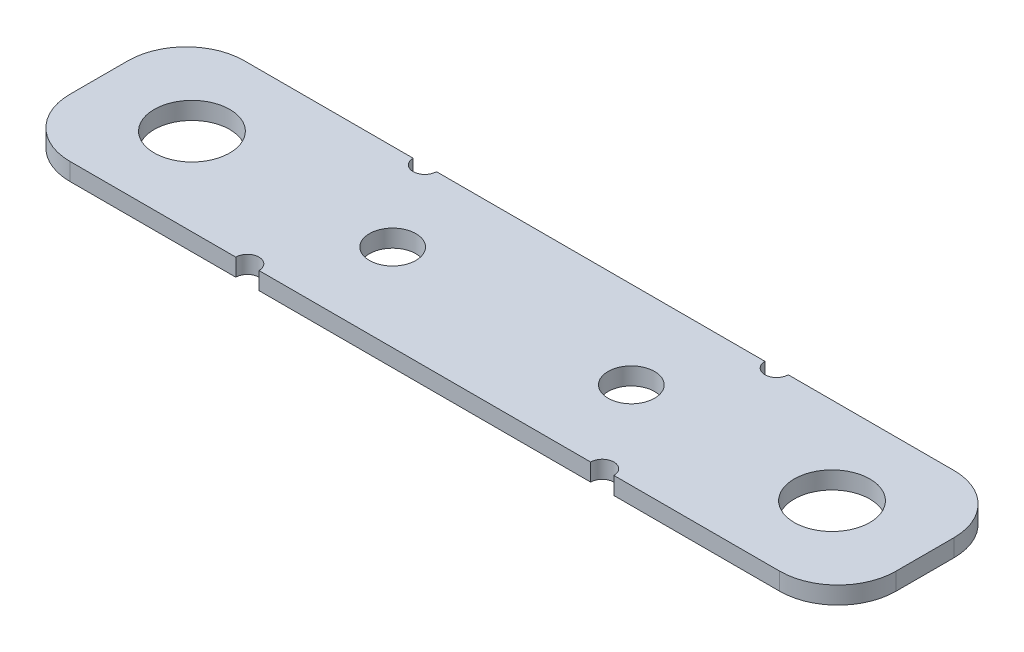
ISO-10303-21;
HEADER;
FILE_DESCRIPTION(('STEP AP214'),'2;1');
FILE_NAME('part.step','',(''),(''),'','','');
FILE_SCHEMA(('AUTOMOTIVE_DESIGN { 1 0 10303 214 1 1 1 1 }'));
ENDSEC;
DATA;
#1=APPLICATION_CONTEXT('core data for automotive mechanical design processes');
#2=APPLICATION_PROTOCOL_DEFINITION('international standard','automotive_design',2000,#1);
#3=PRODUCT_CONTEXT('',#1,'mechanical');
#4=PRODUCT('Part','Part','',(#3));
#5=PRODUCT_RELATED_PRODUCT_CATEGORY('part','',(#4));
#6=PRODUCT_DEFINITION_FORMATION('','',#4);
#7=PRODUCT_DEFINITION_CONTEXT('part definition',#1,'design');
#8=PRODUCT_DEFINITION('design','',#6,#7);
#9=PRODUCT_DEFINITION_SHAPE('','',#8);
#10=(LENGTH_UNIT() NAMED_UNIT(*) SI_UNIT(.MILLI.,.METRE.));
#11=(NAMED_UNIT(*) PLANE_ANGLE_UNIT() SI_UNIT($,.RADIAN.));
#12=(NAMED_UNIT(*) SI_UNIT($,.STERADIAN.) SOLID_ANGLE_UNIT());
#13=UNCERTAINTY_MEASURE_WITH_UNIT(LENGTH_MEASURE(1.E-05),#10,'distance_accuracy_value','');
#14=(GEOMETRIC_REPRESENTATION_CONTEXT(3) GLOBAL_UNCERTAINTY_ASSIGNED_CONTEXT((#13)) GLOBAL_UNIT_ASSIGNED_CONTEXT((#10,
#11,#12)) REPRESENTATION_CONTEXT('',''));
#15=CARTESIAN_POINT('',(0.,0.,0.));
#16=DIRECTION('',(0.,0.,1.));
#17=DIRECTION('',(1.,0.,0.));
#18=AXIS2_PLACEMENT_3D('',#15,#16,#17);
#19=CARTESIAN_POINT('',(-1.5,1.5,15.));
#20=DIRECTION('',(0.,0.,1.));
#21=DIRECTION('',(1.,0.,0.));
#22=AXIS2_PLACEMENT_3D('',#19,#20,#21);
#23=PLANE('',#22);
#24=DIRECTION('',(0.,1.,0.));
#25=VECTOR('',#24,1.);
#26=CARTESIAN_POINT('',(31.2671458676443,-1.5,15.));
#27=LINE('',#26,#25);
#28=CARTESIAN_POINT('',(31.2671458676443,-1.5,15.));
#29=VERTEX_POINT('',#28);
#30=CARTESIAN_POINT('',(31.2671458676443,0.,15.));
#31=VERTEX_POINT('',#30);
#32=EDGE_CURVE('E251',#29,#31,#27,.T.);
#33=ORIENTED_EDGE('',*,*,#32,.F.);
#34=DIRECTION('',(1.,0.,0.));
#35=VECTOR('',#34,1.);
#36=CARTESIAN_POINT('',(0.,-1.5,15.));
#37=LINE('',#36,#35);
#38=CARTESIAN_POINT('',(45.5342917352885,-1.5,15.));
#39=VERTEX_POINT('',#38);
#40=EDGE_CURVE('E240',#29,#39,#37,.T.);
#41=ORIENTED_EDGE('',*,*,#40,.T.);
#42=DIRECTION('',(0.,-1.,0.));
#43=VECTOR('',#42,1.);
#44=CARTESIAN_POINT('',(45.5342917352885,1.5,15.));
#45=LINE('',#44,#43);
#46=CARTESIAN_POINT('',(45.5342917352885,0.,15.));
#47=VERTEX_POINT('',#46);
#48=EDGE_CURVE('E249',#39,#47,#45,.F.);
#49=ORIENTED_EDGE('',*,*,#48,.T.);
#50=DIRECTION('',(1.,0.,0.));
#51=VECTOR('',#50,1.);
#52=CARTESIAN_POINT('',(0.,0.,15.));
#53=LINE('',#52,#51);
#54=EDGE_CURVE('E183',#31,#47,#53,.T.);
#55=ORIENTED_EDGE('',*,*,#54,.F.);
#56=EDGE_LOOP('',(#33,#41,#49,#55));
#57=FACE_BOUND('',#56,.T.);
#58=ADVANCED_FACE('F44',(#57),#23,.T.);
#59=DIRECTION('',(0.,1.,0.));
#60=VECTOR('',#59,1.);
#61=CARTESIAN_POINT('',(29.2671458676443,-1.5,15.));
#62=LINE('',#61,#60);
#63=CARTESIAN_POINT('',(29.2671458676443,0.,15.));
#64=VERTEX_POINT('',#63);
#65=CARTESIAN_POINT('',(29.2671458676443,-1.5,15.));
#66=VERTEX_POINT('',#65);
#67=EDGE_CURVE('E59',#64,#66,#62,.F.);
#68=ORIENTED_EDGE('',*,*,#67,.F.);
#69=CARTESIAN_POINT('',(0.732854132355741,0.,15.));
#70=VERTEX_POINT('',#69);
#71=EDGE_CURVE('E187',#70,#64,#53,.T.);
#72=ORIENTED_EDGE('',*,*,#71,.F.);
#73=DIRECTION('',(0.,1.,0.));
#74=VECTOR('',#73,1.);
#75=CARTESIAN_POINT('',(0.732854132355741,-1.5,15.));
#76=LINE('',#75,#74);
#77=CARTESIAN_POINT('',(0.732854132355741,-1.5,15.));
#78=VERTEX_POINT('',#77);
#79=EDGE_CURVE('E284',#78,#70,#76,.T.);
#80=ORIENTED_EDGE('',*,*,#79,.F.);
#81=EDGE_CURVE('E241',#78,#66,#37,.T.);
#82=ORIENTED_EDGE('',*,*,#81,.T.);
#83=EDGE_LOOP('',(#68,#72,#80,#82));
#84=FACE_BOUND('',#83,.T.);
#85=ADVANCED_FACE('F308',(#84),#23,.T.);
#86=CARTESIAN_POINT('',(31.5,1.5,0.));
#87=DIRECTION('',(0.,0.,-1.));
#88=DIRECTION('',(-1.,0.,0.));
#89=AXIS2_PLACEMENT_3D('',#86,#87,#88);
#90=PLANE('',#89);
#91=DIRECTION('',(0.,1.,0.));
#92=VECTOR('',#91,1.);
#93=CARTESIAN_POINT('',(29.2671458676443,-1.5,0.));
#94=LINE('',#93,#92);
#95=CARTESIAN_POINT('',(29.2671458676443,-1.5,0.));
#96=VERTEX_POINT('',#95);
#97=CARTESIAN_POINT('',(29.2671458676443,0.,0.));
#98=VERTEX_POINT('',#97);
#99=EDGE_CURVE('E321',#96,#98,#94,.T.);
#100=ORIENTED_EDGE('',*,*,#99,.F.);
#101=DIRECTION('',(1.,0.,0.));
#102=VECTOR('',#101,1.);
#103=CARTESIAN_POINT('',(0.,-1.5,0.));
#104=LINE('',#103,#102);
#105=CARTESIAN_POINT('',(1.,-1.5,0.));
#106=VERTEX_POINT('',#105);
#107=EDGE_CURVE('E184',#106,#96,#104,.T.);
#108=ORIENTED_EDGE('',*,*,#107,.F.);
#109=DIRECTION('',(0.,1.,0.));
#110=VECTOR('',#109,1.);
#111=CARTESIAN_POINT('',(1.,-1.5,0.));
#112=LINE('',#111,#110);
#113=CARTESIAN_POINT('',(1.,0.,0.));
#114=VERTEX_POINT('',#113);
#115=EDGE_CURVE('E161',#114,#106,#112,.F.);
#116=ORIENTED_EDGE('',*,*,#115,.F.);
#117=DIRECTION('',(1.,0.,0.));
#118=VECTOR('',#117,1.);
#119=CARTESIAN_POINT('',(0.,0.,0.));
#120=LINE('',#119,#118);
#121=EDGE_CURVE('E193',#114,#98,#120,.T.);
#122=ORIENTED_EDGE('',*,*,#121,.T.);
#123=EDGE_LOOP('',(#100,#108,#116,#122));
#124=FACE_BOUND('',#123,.T.);
#125=ADVANCED_FACE('F313',(#124),#90,.T.);
#126=DIRECTION('',(0.,1.,0.));
#127=VECTOR('',#126,1.);
#128=CARTESIAN_POINT('',(-1.,-1.5,0.));
#129=LINE('',#128,#127);
#130=CARTESIAN_POINT('',(-1.,-1.5,0.));
#131=VERTEX_POINT('',#130);
#132=CARTESIAN_POINT('',(-1.,0.,0.));
#133=VERTEX_POINT('',#132);
#134=EDGE_CURVE('E158',#131,#133,#129,.T.);
#135=ORIENTED_EDGE('',*,*,#134,.F.);
#136=CARTESIAN_POINT('',(-15.5342917352885,-1.5,0.));
#137=VERTEX_POINT('',#136);
#138=EDGE_CURVE('E171',#137,#131,#104,.T.);
#139=ORIENTED_EDGE('',*,*,#138,.F.);
#140=DIRECTION('',(0.,1.,0.));
#141=VECTOR('',#140,1.);
#142=CARTESIAN_POINT('',(-15.5342917352885,1.5,0.));
#143=LINE('',#142,#141);
#144=CARTESIAN_POINT('',(-15.5342917352885,0.,0.));
#145=VERTEX_POINT('',#144);
#146=EDGE_CURVE('E221',#137,#145,#143,.T.);
#147=ORIENTED_EDGE('',*,*,#146,.T.);
#148=EDGE_CURVE('E173',#145,#133,#120,.T.);
#149=ORIENTED_EDGE('',*,*,#148,.T.);
#150=EDGE_LOOP('',(#135,#139,#147,#149));
#151=FACE_BOUND('',#150,.T.);
#152=ADVANCED_FACE('F169',(#151),#90,.T.);
#153=DIRECTION('',(0.,1.,0.));
#154=VECTOR('',#153,1.);
#155=CARTESIAN_POINT('',(-1.26714586764426,-1.5,15.));
#156=LINE('',#155,#154);
#157=CARTESIAN_POINT('',(-1.26714586764426,0.,15.));
#158=VERTEX_POINT('',#157);
#159=CARTESIAN_POINT('',(-1.26714586764426,-1.5,15.));
#160=VERTEX_POINT('',#159);
#161=EDGE_CURVE('E67',#158,#160,#156,.F.);
#162=ORIENTED_EDGE('',*,*,#161,.F.);
#163=CARTESIAN_POINT('',(-15.5342917352885,0.,15.));
#164=VERTEX_POINT('',#163);
#165=EDGE_CURVE('E189',#164,#158,#53,.T.);
#166=ORIENTED_EDGE('',*,*,#165,.F.);
#167=DIRECTION('',(0.,1.,0.));
#168=VECTOR('',#167,1.);
#169=CARTESIAN_POINT('',(-15.5342917352885,-1.5,15.));
#170=LINE('',#169,#168);
#171=CARTESIAN_POINT('',(-15.5342917352885,-1.5,15.));
#172=VERTEX_POINT('',#171);
#173=EDGE_CURVE('E197',#164,#172,#170,.F.);
#174=ORIENTED_EDGE('',*,*,#173,.T.);
#175=EDGE_CURVE('E166',#172,#160,#37,.T.);
#176=ORIENTED_EDGE('',*,*,#175,.T.);
#177=EDGE_LOOP('',(#162,#166,#174,#176));
#178=FACE_BOUND('',#177,.T.);
#179=ADVANCED_FACE('F309',(#178),#23,.T.);
#180=DIRECTION('',(0.,1.,0.));
#181=VECTOR('',#180,1.);
#182=CARTESIAN_POINT('',(31.2671458676443,-1.5,0.));
#183=LINE('',#182,#181);
#184=CARTESIAN_POINT('',(31.2671458676443,0.,0.));
#185=VERTEX_POINT('',#184);
#186=CARTESIAN_POINT('',(31.2671458676443,-1.5,0.));
#187=VERTEX_POINT('',#186);
#188=EDGE_CURVE('E174',#185,#187,#183,.F.);
#189=ORIENTED_EDGE('',*,*,#188,.F.);
#190=CARTESIAN_POINT('',(45.5342917352885,0.,0.));
#191=VERTEX_POINT('',#190);
#192=EDGE_CURVE('E194',#185,#191,#120,.T.);
#193=ORIENTED_EDGE('',*,*,#192,.T.);
#194=DIRECTION('',(0.,-1.,0.));
#195=VECTOR('',#194,1.);
#196=CARTESIAN_POINT('',(45.5342917352885,1.5,0.));
#197=LINE('',#196,#195);
#198=CARTESIAN_POINT('',(45.5342917352885,-1.5,0.));
#199=VERTEX_POINT('',#198);
#200=EDGE_CURVE('E238',#191,#199,#197,.T.);
#201=ORIENTED_EDGE('',*,*,#200,.T.);
#202=EDGE_CURVE('E186',#187,#199,#104,.T.);
#203=ORIENTED_EDGE('',*,*,#202,.F.);
#204=EDGE_LOOP('',(#189,#193,#201,#203));
#205=FACE_BOUND('',#204,.T.);
#206=ADVANCED_FACE('F289',(#205),#90,.T.);
#207=CARTESIAN_POINT('',(0.,0.,15.));
#208=DIRECTION('',(0.,1.,0.));
#209=DIRECTION('',(0.,0.,1.));
#210=AXIS2_PLACEMENT_3D('',#207,#208,#209);
#211=PLANE('',#210);
#212=CARTESIAN_POINT('',(4.73285413235574,0.,7.50000000000001));
#213=DIRECTION('',(0.,1.,0.));
#214=DIRECTION('',(0.,0.,1.));
#215=AXIS2_PLACEMENT_3D('',#212,#213,#214);
#216=CIRCLE('',#215,2.);
#217=CARTESIAN_POINT('',(4.73285413235574,0.,9.50000000000001));
#218=VERTEX_POINT('',#217);
#219=EDGE_CURVE('E363',#218,#218,#216,.T.);
#220=ORIENTED_EDGE('',*,*,#219,.F.);
#221=EDGE_LOOP('',(#220));
#222=FACE_BOUND('',#221,.T.);
#223=CARTESIAN_POINT('',(30.2671458676443,0.,15.));
#224=DIRECTION('',(0.,1.,0.));
#225=DIRECTION('',(0.,0.,1.));
#226=AXIS2_PLACEMENT_3D('',#223,#224,#225);
#227=CIRCLE('',#226,1.);
#228=EDGE_CURVE('E353',#31,#64,#227,.T.);
#229=ORIENTED_EDGE('',*,*,#228,.F.);
#230=ORIENTED_EDGE('',*,*,#54,.T.);
#231=CARTESIAN_POINT('',(45.5342917352885,0.,10.));
#232=DIRECTION('',(0.,1.,0.));
#233=DIRECTION('',(0.,0.,1.));
#234=AXIS2_PLACEMENT_3D('',#231,#232,#233);
#235=CIRCLE('',#234,5.);
#236=CARTESIAN_POINT('',(50.5342917352885,0.,10.));
#237=VERTEX_POINT('',#236);
#238=EDGE_CURVE('E261',#47,#237,#235,.T.);
#239=ORIENTED_EDGE('',*,*,#238,.T.);
#240=DIRECTION('',(0.,0.,-1.));
#241=VECTOR('',#240,1.);
#242=CARTESIAN_POINT('',(50.5342917352885,0.,15.));
#243=LINE('',#242,#241);
#244=CARTESIAN_POINT('',(50.5342917352885,0.,5.));
#245=VERTEX_POINT('',#244);
#246=EDGE_CURVE('E268',#237,#245,#243,.T.);
#247=ORIENTED_EDGE('',*,*,#246,.T.);
#248=CARTESIAN_POINT('',(45.5342917352885,0.,5.));
#249=DIRECTION('',(0.,1.,0.));
#250=DIRECTION('',(0.,0.,1.));
#251=AXIS2_PLACEMENT_3D('',#248,#249,#250);
#252=CIRCLE('',#251,5.);
#253=EDGE_CURVE('E264',#245,#191,#252,.T.);
#254=ORIENTED_EDGE('',*,*,#253,.T.);
#255=ORIENTED_EDGE('',*,*,#192,.F.);
#256=CARTESIAN_POINT('',(30.2671458676443,0.,0.));
#257=DIRECTION('',(0.,1.,0.));
#258=DIRECTION('',(0.,0.,1.));
#259=AXIS2_PLACEMENT_3D('',#256,#257,#258);
#260=CIRCLE('',#259,1.);
#261=EDGE_CURVE('E340',#98,#185,#260,.T.);
#262=ORIENTED_EDGE('',*,*,#261,.F.);
#263=ORIENTED_EDGE('',*,*,#121,.F.);
#264=CARTESIAN_POINT('',(0.,0.,0.));
#265=DIRECTION('',(0.,1.,0.));
#266=DIRECTION('',(0.,0.,1.));
#267=AXIS2_PLACEMENT_3D('',#264,#265,#266);
#268=CIRCLE('',#267,1.);
#269=EDGE_CURVE('E339',#133,#114,#268,.T.);
#270=ORIENTED_EDGE('',*,*,#269,.F.);
#271=ORIENTED_EDGE('',*,*,#148,.F.);
#272=CARTESIAN_POINT('',(-15.5342917352885,0.,5.));
#273=DIRECTION('',(0.,1.,0.));
#274=DIRECTION('',(-1.,0.,0.));
#275=AXIS2_PLACEMENT_3D('',#272,#273,#274);
#276=CIRCLE('',#275,5.);
#277=CARTESIAN_POINT('',(-20.5342917352885,0.,5.));
#278=VERTEX_POINT('',#277);
#279=EDGE_CURVE('E226',#145,#278,#276,.T.);
#280=ORIENTED_EDGE('',*,*,#279,.T.);
#281=DIRECTION('',(0.,0.,-1.));
#282=VECTOR('',#281,1.);
#283=CARTESIAN_POINT('',(-20.5342917352885,0.,15.));
#284=LINE('',#283,#282);
#285=CARTESIAN_POINT('',(-20.5342917352885,0.,10.));
#286=VERTEX_POINT('',#285);
#287=EDGE_CURVE('E236',#286,#278,#284,.T.);
#288=ORIENTED_EDGE('',*,*,#287,.F.);
#289=CARTESIAN_POINT('',(-15.5342917352885,0.,10.));
#290=DIRECTION('',(0.,1.,0.));
#291=DIRECTION('',(-1.,0.,0.));
#292=AXIS2_PLACEMENT_3D('',#289,#290,#291);
#293=CIRCLE('',#292,5.);
#294=EDGE_CURVE('E223',#286,#164,#293,.T.);
#295=ORIENTED_EDGE('',*,*,#294,.T.);
#296=ORIENTED_EDGE('',*,*,#165,.T.);
#297=CARTESIAN_POINT('',(-0.267145867644259,0.,15.));
#298=DIRECTION('',(0.,1.,0.));
#299=DIRECTION('',(0.,0.,1.));
#300=AXIS2_PLACEMENT_3D('',#297,#298,#299);
#301=CIRCLE('',#300,1.);
#302=EDGE_CURVE('E325',#70,#158,#301,.T.);
#303=ORIENTED_EDGE('',*,*,#302,.F.);
#304=ORIENTED_EDGE('',*,*,#71,.T.);
#305=EDGE_LOOP('',(#229,#230,#239,#247,#254,#255,#262,#263,#270,#271,#280,#288,#295,#296,#303,#304));
#306=FACE_BOUND('',#305,.T.);
#307=CARTESIAN_POINT('',(25.2671458676443,0.,7.5));
#308=DIRECTION('',(0.,1.,0.));
#309=DIRECTION('',(0.,0.,1.));
#310=AXIS2_PLACEMENT_3D('',#307,#308,#309);
#311=CIRCLE('',#310,2.);
#312=CARTESIAN_POINT('',(25.2671458676443,0.,9.50000000000001));
#313=VERTEX_POINT('',#312);
#314=EDGE_CURVE('E358',#313,#313,#311,.T.);
#315=ORIENTED_EDGE('',*,*,#314,.F.);
#316=EDGE_LOOP('',(#315));
#317=FACE_BOUND('',#316,.T.);
#318=CARTESIAN_POINT('',(-12.5342917352885,0.,7.5));
#319=DIRECTION('',(0.,1.,0.));
#320=DIRECTION('',(-1.,0.,0.));
#321=AXIS2_PLACEMENT_3D('',#318,#319,#320);
#322=CIRCLE('',#321,3.25);
#323=CARTESIAN_POINT('',(-15.7842917352885,0.,7.5));
#324=VERTEX_POINT('',#323);
#325=EDGE_CURVE('E228',#324,#324,#322,.T.);
#326=ORIENTED_EDGE('',*,*,#325,.F.);
#327=EDGE_LOOP('',(#326));
#328=FACE_BOUND('',#327,.T.);
#329=CARTESIAN_POINT('',(42.5342917352885,0.,7.5));
#330=DIRECTION('',(0.,1.,0.));
#331=DIRECTION('',(0.,0.,1.));
#332=AXIS2_PLACEMENT_3D('',#329,#330,#331);
#333=CIRCLE('',#332,3.25);
#334=CARTESIAN_POINT('',(42.5342917352885,0.,10.75));
#335=VERTEX_POINT('',#334);
#336=EDGE_CURVE('E274',#335,#335,#333,.T.);
#337=ORIENTED_EDGE('',*,*,#336,.F.);
#338=EDGE_LOOP('',(#337));
#339=FACE_BOUND('',#338,.T.);
#340=ADVANCED_FACE('F46',(#222,#306,#317,#328,#339),#211,.T.);
#341=CARTESIAN_POINT('',(0.,-1.5,15.));
#342=DIRECTION('',(0.,1.,0.));
#343=DIRECTION('',(0.,0.,1.));
#344=AXIS2_PLACEMENT_3D('',#341,#342,#343);
#345=PLANE('',#344);
#346=CARTESIAN_POINT('',(4.73285413235574,-1.5,7.50000000000001));
#347=DIRECTION('',(0.,1.,0.));
#348=DIRECTION('',(0.,0.,1.));
#349=AXIS2_PLACEMENT_3D('',#346,#347,#348);
#350=CIRCLE('',#349,2.);
#351=CARTESIAN_POINT('',(4.73285413235574,-1.5,9.50000000000001));
#352=VERTEX_POINT('',#351);
#353=EDGE_CURVE('E355',#352,#352,#350,.T.);
#354=ORIENTED_EDGE('',*,*,#353,.T.);
#355=EDGE_LOOP('',(#354));
#356=FACE_BOUND('',#355,.T.);
#357=CARTESIAN_POINT('',(25.2671458676443,-1.5,7.5));
#358=DIRECTION('',(0.,1.,0.));
#359=DIRECTION('',(0.,0.,1.));
#360=AXIS2_PLACEMENT_3D('',#357,#358,#359);
#361=CIRCLE('',#360,2.);
#362=CARTESIAN_POINT('',(25.2671458676443,-1.5,9.50000000000001));
#363=VERTEX_POINT('',#362);
#364=EDGE_CURVE('E365',#363,#363,#361,.T.);
#365=ORIENTED_EDGE('',*,*,#364,.T.);
#366=EDGE_LOOP('',(#365));
#367=FACE_BOUND('',#366,.T.);
#368=ORIENTED_EDGE('',*,*,#40,.F.);
#369=CARTESIAN_POINT('',(30.2671458676443,-1.5,15.));
#370=DIRECTION('',(0.,1.,0.));
#371=DIRECTION('',(0.,0.,1.));
#372=AXIS2_PLACEMENT_3D('',#369,#370,#371);
#373=CIRCLE('',#372,1.);
#374=EDGE_CURVE('E352',#29,#66,#373,.T.);
#375=ORIENTED_EDGE('',*,*,#374,.T.);
#376=ORIENTED_EDGE('',*,*,#81,.F.);
#377=CARTESIAN_POINT('',(-0.267145867644259,-1.5,15.));
#378=DIRECTION('',(0.,1.,0.));
#379=DIRECTION('',(0.,0.,1.));
#380=AXIS2_PLACEMENT_3D('',#377,#378,#379);
#381=CIRCLE('',#380,1.);
#382=EDGE_CURVE('E343',#78,#160,#381,.T.);
#383=ORIENTED_EDGE('',*,*,#382,.T.);
#384=ORIENTED_EDGE('',*,*,#175,.F.);
#385=CARTESIAN_POINT('',(-15.5342917352885,-1.5,10.));
#386=DIRECTION('',(0.,1.,0.));
#387=DIRECTION('',(-1.,0.,0.));
#388=AXIS2_PLACEMENT_3D('',#385,#386,#387);
#389=CIRCLE('',#388,5.);
#390=CARTESIAN_POINT('',(-20.5342917352885,-1.5,10.));
#391=VERTEX_POINT('',#390);
#392=EDGE_CURVE('E204',#172,#391,#389,.F.);
#393=ORIENTED_EDGE('',*,*,#392,.T.);
#394=DIRECTION('',(0.,0.,-1.));
#395=VECTOR('',#394,1.);
#396=CARTESIAN_POINT('',(-20.5342917352885,-1.5,15.));
#397=LINE('',#396,#395);
#398=CARTESIAN_POINT('',(-20.5342917352885,-1.5,5.));
#399=VERTEX_POINT('',#398);
#400=EDGE_CURVE('E216',#391,#399,#397,.T.);
#401=ORIENTED_EDGE('',*,*,#400,.T.);
#402=CARTESIAN_POINT('',(-15.5342917352885,-1.5,5.));
#403=DIRECTION('',(0.,1.,0.));
#404=DIRECTION('',(-1.,0.,0.));
#405=AXIS2_PLACEMENT_3D('',#402,#403,#404);
#406=CIRCLE('',#405,5.);
#407=EDGE_CURVE('E181',#399,#137,#406,.F.);
#408=ORIENTED_EDGE('',*,*,#407,.T.);
#409=ORIENTED_EDGE('',*,*,#138,.T.);
#410=CARTESIAN_POINT('',(0.,-1.5,0.));
#411=DIRECTION('',(0.,1.,0.));
#412=DIRECTION('',(0.,0.,1.));
#413=AXIS2_PLACEMENT_3D('',#410,#411,#412);
#414=CIRCLE('',#413,1.);
#415=EDGE_CURVE('E52',#131,#106,#414,.T.);
#416=ORIENTED_EDGE('',*,*,#415,.T.);
#417=ORIENTED_EDGE('',*,*,#107,.T.);
#418=CARTESIAN_POINT('',(30.2671458676443,-1.5,0.));
#419=DIRECTION('',(0.,1.,0.));
#420=DIRECTION('',(0.,0.,1.));
#421=AXIS2_PLACEMENT_3D('',#418,#419,#420);
#422=CIRCLE('',#421,1.);
#423=EDGE_CURVE('E12',#96,#187,#422,.T.);
#424=ORIENTED_EDGE('',*,*,#423,.T.);
#425=ORIENTED_EDGE('',*,*,#202,.T.);
#426=CARTESIAN_POINT('',(45.5342917352885,-1.5,5.));
#427=DIRECTION('',(0.,1.,0.));
#428=DIRECTION('',(0.,0.,1.));
#429=AXIS2_PLACEMENT_3D('',#426,#427,#428);
#430=CIRCLE('',#429,5.);
#431=CARTESIAN_POINT('',(50.5342917352885,-1.5,5.));
#432=VERTEX_POINT('',#431);
#433=EDGE_CURVE('E258',#199,#432,#430,.F.);
#434=ORIENTED_EDGE('',*,*,#433,.T.);
#435=DIRECTION('',(0.,0.,-1.));
#436=VECTOR('',#435,1.);
#437=CARTESIAN_POINT('',(50.5342917352885,-1.5,15.));
#438=LINE('',#437,#436);
#439=CARTESIAN_POINT('',(50.5342917352885,-1.5,10.));
#440=VERTEX_POINT('',#439);
#441=EDGE_CURVE('E212',#440,#432,#438,.T.);
#442=ORIENTED_EDGE('',*,*,#441,.F.);
#443=CARTESIAN_POINT('',(45.5342917352885,-1.5,10.));
#444=DIRECTION('',(0.,1.,0.));
#445=DIRECTION('',(0.,0.,1.));
#446=AXIS2_PLACEMENT_3D('',#443,#444,#445);
#447=CIRCLE('',#446,5.);
#448=EDGE_CURVE('E253',#440,#39,#447,.F.);
#449=ORIENTED_EDGE('',*,*,#448,.T.);
#450=EDGE_LOOP('',(#368,#375,#376,#383,#384,#393,#401,#408,#409,#416,#417,#424,#425,#434,#442,#449));
#451=FACE_BOUND('',#450,.T.);
#452=CARTESIAN_POINT('',(-12.5342917352885,-1.5,7.5));
#453=DIRECTION('',(0.,1.,0.));
#454=DIRECTION('',(0.,0.,-1.));
#455=AXIS2_PLACEMENT_3D('',#452,#453,#454);
#456=CIRCLE('',#455,3.25);
#457=CARTESIAN_POINT('',(-12.5342917352885,-1.5,4.25));
#458=VERTEX_POINT('',#457);
#459=EDGE_CURVE('E218',#458,#458,#456,.T.);
#460=ORIENTED_EDGE('',*,*,#459,.T.);
#461=EDGE_LOOP('',(#460));
#462=FACE_BOUND('',#461,.T.);
#463=CARTESIAN_POINT('',(42.5342917352885,-1.5,7.5));
#464=DIRECTION('',(0.,-1.,0.));
#465=DIRECTION('',(0.,0.,-1.));
#466=AXIS2_PLACEMENT_3D('',#463,#464,#465);
#467=CIRCLE('',#466,3.25);
#468=CARTESIAN_POINT('',(42.5342917352885,-1.5,4.25));
#469=VERTEX_POINT('',#468);
#470=EDGE_CURVE('E271',#469,#469,#467,.T.);
#471=ORIENTED_EDGE('',*,*,#470,.F.);
#472=EDGE_LOOP('',(#471));
#473=FACE_BOUND('',#472,.T.);
#474=ADVANCED_FACE('F177',(#356,#367,#451,#462,#473),#345,.F.);
#475=CARTESIAN_POINT('',(-15.5342917352885,-1.5,10.));
#476=DIRECTION('',(0.,-1.,0.));
#477=DIRECTION('',(0.,0.,1.));
#478=AXIS2_PLACEMENT_3D('',#475,#476,#477);
#479=CYLINDRICAL_SURFACE('',#478,5.);
#480=ORIENTED_EDGE('',*,*,#392,.F.);
#481=ORIENTED_EDGE('',*,*,#173,.F.);
#482=ORIENTED_EDGE('',*,*,#294,.F.);
#483=DIRECTION('',(0.,1.,0.));
#484=VECTOR('',#483,1.);
#485=CARTESIAN_POINT('',(-20.5342917352885,0.,10.));
#486=LINE('',#485,#484);
#487=EDGE_CURVE('E231',#391,#286,#486,.T.);
#488=ORIENTED_EDGE('',*,*,#487,.F.);
#489=EDGE_LOOP('',(#480,#481,#482,#488));
#490=FACE_BOUND('',#489,.T.);
#491=ADVANCED_FACE('F330',(#490),#479,.T.);
#492=CARTESIAN_POINT('',(-20.5342917352885,-1.5,15.));
#493=DIRECTION('',(-1.,0.,0.));
#494=DIRECTION('',(0.,0.,1.));
#495=AXIS2_PLACEMENT_3D('',#492,#493,#494);
#496=PLANE('',#495);
#497=ORIENTED_EDGE('',*,*,#287,.T.);
#498=DIRECTION('',(0.,1.,0.));
#499=VECTOR('',#498,1.);
#500=CARTESIAN_POINT('',(-20.5342917352885,-1.5,5.));
#501=LINE('',#500,#499);
#502=EDGE_CURVE('E234',#278,#399,#501,.F.);
#503=ORIENTED_EDGE('',*,*,#502,.T.);
#504=ORIENTED_EDGE('',*,*,#400,.F.);
#505=ORIENTED_EDGE('',*,*,#487,.T.);
#506=EDGE_LOOP('',(#497,#503,#504,#505));
#507=FACE_BOUND('',#506,.T.);
#508=ADVANCED_FACE('F333',(#507),#496,.T.);
#509=CARTESIAN_POINT('',(-15.5342917352885,1.5,5.));
#510=DIRECTION('',(0.,1.,0.));
#511=DIRECTION('',(0.,0.,-1.));
#512=AXIS2_PLACEMENT_3D('',#509,#510,#511);
#513=CYLINDRICAL_SURFACE('',#512,5.);
#514=ORIENTED_EDGE('',*,*,#407,.F.);
#515=ORIENTED_EDGE('',*,*,#502,.F.);
#516=ORIENTED_EDGE('',*,*,#279,.F.);
#517=ORIENTED_EDGE('',*,*,#146,.F.);
#518=EDGE_LOOP('',(#514,#515,#516,#517));
#519=FACE_BOUND('',#518,.T.);
#520=ADVANCED_FACE('F337',(#519),#513,.T.);
#521=CARTESIAN_POINT('',(-12.5342917352885,-1.5,7.5));
#522=DIRECTION('',(0.,1.,0.));
#523=DIRECTION('',(0.,0.,-1.));
#524=AXIS2_PLACEMENT_3D('',#521,#522,#523);
#525=CYLINDRICAL_SURFACE('',#524,3.25);
#526=ORIENTED_EDGE('',*,*,#325,.T.);
#527=EDGE_LOOP('',(#526));
#528=FACE_BOUND('',#527,.T.);
#529=ORIENTED_EDGE('',*,*,#459,.F.);
#530=EDGE_LOOP('',(#529));
#531=FACE_BOUND('',#530,.T.);
#532=ADVANCED_FACE('F392',(#528,#531),#525,.F.);
#533=CARTESIAN_POINT('',(45.5342917352885,0.,10.));
#534=DIRECTION('',(0.,-1.,0.));
#535=DIRECTION('',(0.,0.,-1.));
#536=AXIS2_PLACEMENT_3D('',#533,#534,#535);
#537=CYLINDRICAL_SURFACE('',#536,5.);
#538=ORIENTED_EDGE('',*,*,#238,.F.);
#539=ORIENTED_EDGE('',*,*,#48,.F.);
#540=ORIENTED_EDGE('',*,*,#448,.F.);
#541=DIRECTION('',(0.,-1.,0.));
#542=VECTOR('',#541,1.);
#543=CARTESIAN_POINT('',(50.5342917352885,0.,10.));
#544=LINE('',#543,#542);
#545=EDGE_CURVE('E277',#237,#440,#544,.T.);
#546=ORIENTED_EDGE('',*,*,#545,.F.);
#547=EDGE_LOOP('',(#538,#539,#540,#546));
#548=FACE_BOUND('',#547,.T.);
#549=ADVANCED_FACE('F260',(#548),#537,.T.);
#550=CARTESIAN_POINT('',(45.5342917352885,1.5,5.));
#551=DIRECTION('',(0.,-1.,0.));
#552=DIRECTION('',(0.,0.,-1.));
#553=AXIS2_PLACEMENT_3D('',#550,#551,#552);
#554=CYLINDRICAL_SURFACE('',#553,5.);
#555=ORIENTED_EDGE('',*,*,#253,.F.);
#556=DIRECTION('',(0.,-1.,0.));
#557=VECTOR('',#556,1.);
#558=CARTESIAN_POINT('',(50.5342917352885,0.,5.));
#559=LINE('',#558,#557);
#560=EDGE_CURVE('E278',#432,#245,#559,.F.);
#561=ORIENTED_EDGE('',*,*,#560,.F.);
#562=ORIENTED_EDGE('',*,*,#433,.F.);
#563=ORIENTED_EDGE('',*,*,#200,.F.);
#564=EDGE_LOOP('',(#555,#561,#562,#563));
#565=FACE_BOUND('',#564,.T.);
#566=ADVANCED_FACE('F292',(#565),#554,.T.);
#567=CARTESIAN_POINT('',(50.5342917352885,0.,15.));
#568=DIRECTION('',(1.,0.,0.));
#569=DIRECTION('',(0.,0.,1.));
#570=AXIS2_PLACEMENT_3D('',#567,#568,#569);
#571=PLANE('',#570);
#572=ORIENTED_EDGE('',*,*,#441,.T.);
#573=ORIENTED_EDGE('',*,*,#560,.T.);
#574=ORIENTED_EDGE('',*,*,#246,.F.);
#575=ORIENTED_EDGE('',*,*,#545,.T.);
#576=EDGE_LOOP('',(#572,#573,#574,#575));
#577=FACE_BOUND('',#576,.T.);
#578=ADVANCED_FACE('F296',(#577),#571,.T.);
#579=CARTESIAN_POINT('',(42.5342917352885,31.5,7.5));
#580=DIRECTION('',(0.,-1.,0.));
#581=DIRECTION('',(0.,0.,-1.));
#582=AXIS2_PLACEMENT_3D('',#579,#580,#581);
#583=CYLINDRICAL_SURFACE('',#582,3.25);
#584=ORIENTED_EDGE('',*,*,#336,.T.);
#585=EDGE_LOOP('',(#584));
#586=FACE_BOUND('',#585,.T.);
#587=ORIENTED_EDGE('',*,*,#470,.T.);
#588=EDGE_LOOP('',(#587));
#589=FACE_BOUND('',#588,.T.);
#590=ADVANCED_FACE('F298',(#586,#589),#583,.F.);
#591=CARTESIAN_POINT('',(0.,-1.5,0.));
#592=DIRECTION('',(0.,1.,0.));
#593=DIRECTION('',(0.,0.,1.));
#594=AXIS2_PLACEMENT_3D('',#591,#592,#593);
#595=CYLINDRICAL_SURFACE('',#594,1.);
#596=ORIENTED_EDGE('',*,*,#134,.T.);
#597=ORIENTED_EDGE('',*,*,#269,.T.);
#598=ORIENTED_EDGE('',*,*,#115,.T.);
#599=ORIENTED_EDGE('',*,*,#415,.F.);
#600=EDGE_LOOP('',(#596,#597,#598,#599));
#601=FACE_BOUND('',#600,.T.);
#602=ADVANCED_FACE('F157',(#601),#595,.F.);
#603=CARTESIAN_POINT('',(25.2671458676443,-1.5,7.5));
#604=DIRECTION('',(0.,1.,0.));
#605=DIRECTION('',(0.,0.,1.));
#606=AXIS2_PLACEMENT_3D('',#603,#604,#605);
#607=CYLINDRICAL_SURFACE('',#606,2.);
#608=ORIENTED_EDGE('',*,*,#364,.F.);
#609=EDGE_LOOP('',(#608));
#610=FACE_BOUND('',#609,.T.);
#611=ORIENTED_EDGE('',*,*,#314,.T.);
#612=EDGE_LOOP('',(#611));
#613=FACE_BOUND('',#612,.T.);
#614=ADVANCED_FACE('F374',(#610,#613),#607,.F.);
#615=CARTESIAN_POINT('',(30.2671458676443,-1.5,0.));
#616=DIRECTION('',(0.,1.,0.));
#617=DIRECTION('',(0.,0.,1.));
#618=AXIS2_PLACEMENT_3D('',#615,#616,#617);
#619=CYLINDRICAL_SURFACE('',#618,1.);
#620=ORIENTED_EDGE('',*,*,#99,.T.);
#621=ORIENTED_EDGE('',*,*,#261,.T.);
#622=ORIENTED_EDGE('',*,*,#188,.T.);
#623=ORIENTED_EDGE('',*,*,#423,.F.);
#624=EDGE_LOOP('',(#620,#621,#622,#623));
#625=FACE_BOUND('',#624,.T.);
#626=ADVANCED_FACE('F505',(#625),#619,.F.);
#627=CARTESIAN_POINT('',(-0.267145867644259,-1.5,15.));
#628=DIRECTION('',(0.,1.,0.));
#629=DIRECTION('',(0.,0.,1.));
#630=AXIS2_PLACEMENT_3D('',#627,#628,#629);
#631=CYLINDRICAL_SURFACE('',#630,1.);
#632=ORIENTED_EDGE('',*,*,#79,.T.);
#633=ORIENTED_EDGE('',*,*,#302,.T.);
#634=ORIENTED_EDGE('',*,*,#161,.T.);
#635=ORIENTED_EDGE('',*,*,#382,.F.);
#636=EDGE_LOOP('',(#632,#633,#634,#635));
#637=FACE_BOUND('',#636,.T.);
#638=ADVANCED_FACE('F350',(#637),#631,.F.);
#639=CARTESIAN_POINT('',(30.2671458676443,-1.5,15.));
#640=DIRECTION('',(0.,1.,0.));
#641=DIRECTION('',(0.,0.,1.));
#642=AXIS2_PLACEMENT_3D('',#639,#640,#641);
#643=CYLINDRICAL_SURFACE('',#642,1.);
#644=ORIENTED_EDGE('',*,*,#32,.T.);
#645=ORIENTED_EDGE('',*,*,#228,.T.);
#646=ORIENTED_EDGE('',*,*,#67,.T.);
#647=ORIENTED_EDGE('',*,*,#374,.F.);
#648=EDGE_LOOP('',(#644,#645,#646,#647));
#649=FACE_BOUND('',#648,.T.);
#650=ADVANCED_FACE('F524',(#649),#643,.F.);
#651=CARTESIAN_POINT('',(4.73285413235574,-1.5,7.50000000000001));
#652=DIRECTION('',(0.,1.,0.));
#653=DIRECTION('',(0.,0.,1.));
#654=AXIS2_PLACEMENT_3D('',#651,#652,#653);
#655=CYLINDRICAL_SURFACE('',#654,2.);
#656=ORIENTED_EDGE('',*,*,#353,.F.);
#657=EDGE_LOOP('',(#656));
#658=FACE_BOUND('',#657,.T.);
#659=ORIENTED_EDGE('',*,*,#219,.T.);
#660=EDGE_LOOP('',(#659));
#661=FACE_BOUND('',#660,.T.);
#662=ADVANCED_FACE('F533',(#658,#661),#655,.F.);
#663=CLOSED_SHELL('',(#58,#85,#125,#152,#179,#206,#340,#474,#491,#508,#520,#532,#549,#566,#578,
#590,#602,#614,#626,#638,#650,#662));
#664=MANIFOLD_SOLID_BREP('B2',#663);
#665=ADVANCED_BREP_SHAPE_REPRESENTATION('',(#18,#664),#14);
#666=SHAPE_DEFINITION_REPRESENTATION(#9,#665);
ENDSEC;
END-ISO-10303-21;
